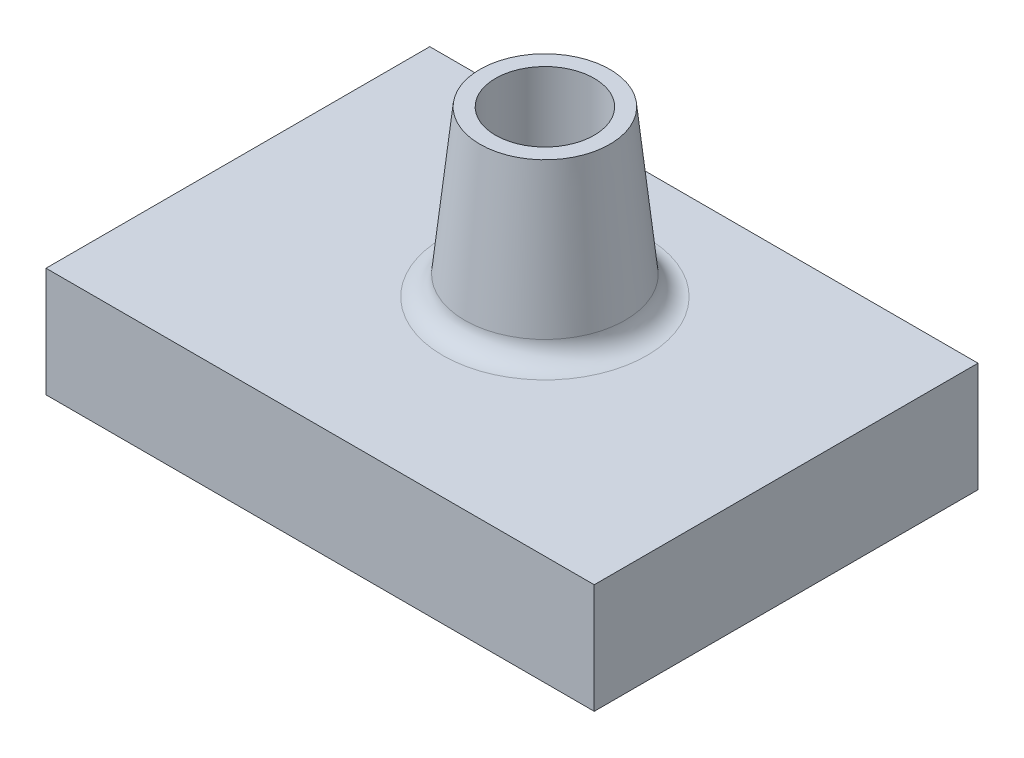
ISO-10303-21;
HEADER;
FILE_DESCRIPTION(('STEP AP214'),'2;1');
FILE_NAME('part.step','',(''),(''),'','','');
FILE_SCHEMA(('AUTOMOTIVE_DESIGN { 1 0 10303 214 1 1 1 1 }'));
ENDSEC;
DATA;
#1=APPLICATION_CONTEXT('core data for automotive mechanical design processes');
#2=APPLICATION_PROTOCOL_DEFINITION('international standard','automotive_design',2000,#1);
#3=PRODUCT_CONTEXT('',#1,'mechanical');
#4=PRODUCT('Part','Part','',(#3));
#5=PRODUCT_RELATED_PRODUCT_CATEGORY('part','',(#4));
#6=PRODUCT_DEFINITION_FORMATION('','',#4);
#7=PRODUCT_DEFINITION_CONTEXT('part definition',#1,'design');
#8=PRODUCT_DEFINITION('design','',#6,#7);
#9=PRODUCT_DEFINITION_SHAPE('','',#8);
#10=(LENGTH_UNIT() NAMED_UNIT(*) SI_UNIT(.MILLI.,.METRE.));
#11=(NAMED_UNIT(*) PLANE_ANGLE_UNIT() SI_UNIT($,.RADIAN.));
#12=(NAMED_UNIT(*) SI_UNIT($,.STERADIAN.) SOLID_ANGLE_UNIT());
#13=UNCERTAINTY_MEASURE_WITH_UNIT(LENGTH_MEASURE(1.E-05),#10,'distance_accuracy_value','');
#14=(GEOMETRIC_REPRESENTATION_CONTEXT(3) GLOBAL_UNCERTAINTY_ASSIGNED_CONTEXT((#13)) GLOBAL_UNIT_ASSIGNED_CONTEXT((#10,
#11,#12)) REPRESENTATION_CONTEXT('',''));
#15=CARTESIAN_POINT('',(0.,0.,0.));
#16=DIRECTION('',(0.,0.,1.));
#17=DIRECTION('',(1.,0.,0.));
#18=AXIS2_PLACEMENT_3D('',#15,#16,#17);
#19=CARTESIAN_POINT('',(25.,10.,-17.5));
#20=DIRECTION('',(-1.,0.,0.));
#21=DIRECTION('',(0.,0.,1.));
#22=AXIS2_PLACEMENT_3D('',#19,#20,#21);
#23=PLANE('',#22);
#24=DIRECTION('',(0.,0.,-1.));
#25=VECTOR('',#24,1.);
#26=CARTESIAN_POINT('',(25.,0.,-17.5));
#27=LINE('',#26,#25);
#28=CARTESIAN_POINT('',(25.,0.,17.5));
#29=VERTEX_POINT('',#28);
#30=CARTESIAN_POINT('',(25.,0.,-17.5));
#31=VERTEX_POINT('',#30);
#32=EDGE_CURVE('E100',#29,#31,#27,.T.);
#33=ORIENTED_EDGE('',*,*,#32,.T.);
#34=DIRECTION('',(0.,-1.,0.));
#35=VECTOR('',#34,1.);
#36=CARTESIAN_POINT('',(25.,10.,-17.5));
#37=LINE('',#36,#35);
#38=CARTESIAN_POINT('',(25.,10.,-17.5));
#39=VERTEX_POINT('',#38);
#40=EDGE_CURVE('E91',#39,#31,#37,.T.);
#41=ORIENTED_EDGE('',*,*,#40,.F.);
#42=DIRECTION('',(0.,0.,-1.));
#43=VECTOR('',#42,1.);
#44=CARTESIAN_POINT('',(25.,10.,-17.5));
#45=LINE('',#44,#43);
#46=CARTESIAN_POINT('',(25.,10.,17.5));
#47=VERTEX_POINT('',#46);
#48=EDGE_CURVE('E85',#47,#39,#45,.T.);
#49=ORIENTED_EDGE('',*,*,#48,.F.);
#50=DIRECTION('',(0.,-1.,0.));
#51=VECTOR('',#50,1.);
#52=CARTESIAN_POINT('',(25.,10.,17.5));
#53=LINE('',#52,#51);
#54=EDGE_CURVE('E96',#47,#29,#53,.T.);
#55=ORIENTED_EDGE('',*,*,#54,.T.);
#56=EDGE_LOOP('',(#33,#41,#49,#55));
#57=FACE_BOUND('',#56,.T.);
#58=ADVANCED_FACE('F32',(#57),#23,.F.);
#59=CARTESIAN_POINT('',(-25.,10.,-17.5));
#60=DIRECTION('',(0.,0.,1.));
#61=DIRECTION('',(1.,0.,0.));
#62=AXIS2_PLACEMENT_3D('',#59,#60,#61);
#63=PLANE('',#62);
#64=DIRECTION('',(-1.,0.,0.));
#65=VECTOR('',#64,1.);
#66=CARTESIAN_POINT('',(-25.,0.,-17.5));
#67=LINE('',#66,#65);
#68=CARTESIAN_POINT('',(-25.,0.,-17.5));
#69=VERTEX_POINT('',#68);
#70=EDGE_CURVE('E90',#31,#69,#67,.T.);
#71=ORIENTED_EDGE('',*,*,#70,.T.);
#72=DIRECTION('',(0.,-1.,0.));
#73=VECTOR('',#72,1.);
#74=CARTESIAN_POINT('',(-25.,10.,-17.5));
#75=LINE('',#74,#73);
#76=CARTESIAN_POINT('',(-25.,10.,-17.5));
#77=VERTEX_POINT('',#76);
#78=EDGE_CURVE('E88',#77,#69,#75,.T.);
#79=ORIENTED_EDGE('',*,*,#78,.F.);
#80=DIRECTION('',(-1.,0.,0.));
#81=VECTOR('',#80,1.);
#82=CARTESIAN_POINT('',(-25.,10.,-17.5));
#83=LINE('',#82,#81);
#84=EDGE_CURVE('E80',#39,#77,#83,.T.);
#85=ORIENTED_EDGE('',*,*,#84,.F.);
#86=ORIENTED_EDGE('',*,*,#40,.T.);
#87=EDGE_LOOP('',(#71,#79,#85,#86));
#88=FACE_BOUND('',#87,.T.);
#89=ADVANCED_FACE('F89',(#88),#63,.F.);
#90=CARTESIAN_POINT('',(-25.,10.,-17.5));
#91=DIRECTION('',(1.,0.,0.));
#92=DIRECTION('',(0.,0.,-1.));
#93=AXIS2_PLACEMENT_3D('',#90,#91,#92);
#94=PLANE('',#93);
#95=DIRECTION('',(0.,0.,1.));
#96=VECTOR('',#95,1.);
#97=CARTESIAN_POINT('',(-25.,0.,-17.5));
#98=LINE('',#97,#96);
#99=CARTESIAN_POINT('',(-25.,0.,17.5));
#100=VERTEX_POINT('',#99);
#101=EDGE_CURVE('E66',#69,#100,#98,.T.);
#102=ORIENTED_EDGE('',*,*,#101,.T.);
#103=DIRECTION('',(0.,-1.,0.));
#104=VECTOR('',#103,1.);
#105=CARTESIAN_POINT('',(-25.,10.,17.5));
#106=LINE('',#105,#104);
#107=CARTESIAN_POINT('',(-25.,10.,17.5));
#108=VERTEX_POINT('',#107);
#109=EDGE_CURVE('E92',#108,#100,#106,.T.);
#110=ORIENTED_EDGE('',*,*,#109,.F.);
#111=DIRECTION('',(0.,0.,1.));
#112=VECTOR('',#111,1.);
#113=CARTESIAN_POINT('',(-25.,10.,-17.5));
#114=LINE('',#113,#112);
#115=EDGE_CURVE('E83',#77,#108,#114,.T.);
#116=ORIENTED_EDGE('',*,*,#115,.F.);
#117=ORIENTED_EDGE('',*,*,#78,.T.);
#118=EDGE_LOOP('',(#102,#110,#116,#117));
#119=FACE_BOUND('',#118,.T.);
#120=ADVANCED_FACE('F94',(#119),#94,.F.);
#121=CARTESIAN_POINT('',(-25.,10.,17.5));
#122=DIRECTION('',(0.,0.,-1.));
#123=DIRECTION('',(-1.,0.,0.));
#124=AXIS2_PLACEMENT_3D('',#121,#122,#123);
#125=PLANE('',#124);
#126=DIRECTION('',(1.,0.,0.));
#127=VECTOR('',#126,1.);
#128=CARTESIAN_POINT('',(-25.,0.,17.5));
#129=LINE('',#128,#127);
#130=EDGE_CURVE('E72',#100,#29,#129,.T.);
#131=ORIENTED_EDGE('',*,*,#130,.T.);
#132=ORIENTED_EDGE('',*,*,#54,.F.);
#133=DIRECTION('',(1.,0.,0.));
#134=VECTOR('',#133,1.);
#135=CARTESIAN_POINT('',(-25.,10.,17.5));
#136=LINE('',#135,#134);
#137=EDGE_CURVE('E49',#108,#47,#136,.T.);
#138=ORIENTED_EDGE('',*,*,#137,.F.);
#139=ORIENTED_EDGE('',*,*,#109,.T.);
#140=EDGE_LOOP('',(#131,#132,#138,#139));
#141=FACE_BOUND('',#140,.T.);
#142=ADVANCED_FACE('F134',(#141),#125,.F.);
#143=CARTESIAN_POINT('',(0.,10.,0.));
#144=DIRECTION('',(0.,1.,0.));
#145=DIRECTION('',(0.,0.,1.));
#146=AXIS2_PLACEMENT_3D('',#143,#144,#145);
#147=PLANE('',#146);
#148=CARTESIAN_POINT('',(0.,10.,-3.00000000000002));
#149=DIRECTION('',(0.,1.,0.));
#150=DIRECTION('',(0.,0.,1.));
#151=AXIS2_PLACEMENT_3D('',#148,#149,#150);
#152=CIRCLE('',#151,9.30080808859568);
#153=CARTESIAN_POINT('',(0.,10.,6.30080808859566));
#154=VERTEX_POINT('',#153);
#155=EDGE_CURVE('E11',#154,#154,#152,.F.);
#156=ORIENTED_EDGE('',*,*,#155,.T.);
#157=EDGE_LOOP('',(#156));
#158=FACE_BOUND('',#157,.T.);
#159=ORIENTED_EDGE('',*,*,#48,.T.);
#160=ORIENTED_EDGE('',*,*,#84,.T.);
#161=ORIENTED_EDGE('',*,*,#115,.T.);
#162=ORIENTED_EDGE('',*,*,#137,.T.);
#163=EDGE_LOOP('',(#159,#160,#161,#162));
#164=FACE_BOUND('',#163,.T.);
#165=ADVANCED_FACE('F81',(#158,#164),#147,.T.);
#166=CARTESIAN_POINT('',(0.,0.,0.));
#167=DIRECTION('',(0.,1.,0.));
#168=DIRECTION('',(0.,0.,1.));
#169=AXIS2_PLACEMENT_3D('',#166,#167,#168);
#170=PLANE('',#169);
#171=ORIENTED_EDGE('',*,*,#32,.F.);
#172=ORIENTED_EDGE('',*,*,#130,.F.);
#173=ORIENTED_EDGE('',*,*,#101,.F.);
#174=ORIENTED_EDGE('',*,*,#70,.F.);
#175=EDGE_LOOP('',(#171,#172,#173,#174));
#176=FACE_BOUND('',#175,.T.);
#177=ADVANCED_FACE('F137',(#176),#170,.F.);
#178=CARTESIAN_POINT('',(0.,10.,-3.00000000000002));
#179=DIRECTION('',(0.,-1.,0.));
#180=DIRECTION('',(0.,0.,1.));
#181=AXIS2_PLACEMENT_3D('',#178,#179,#180);
#182=CONICAL_SURFACE('',#181,7.5,0.10471975511966);
#183=CARTESIAN_POINT('',(0.,11.7909430734647,-3.00000000000002));
#184=DIRECTION('',(0.,1.,0.));
#185=DIRECTION('',(0.,0.,1.));
#186=AXIS2_PLACEMENT_3D('',#183,#184,#185);
#187=CIRCLE('',#186,7.31176429785913);
#188=CARTESIAN_POINT('',(0.,11.7909430734647,4.31176429785912));
#189=VERTEX_POINT('',#188);
#190=EDGE_CURVE('E41',#189,#189,#187,.T.);
#191=ORIENTED_EDGE('',*,*,#190,.T.);
#192=EDGE_LOOP('',(#191));
#193=FACE_BOUND('',#192,.T.);
#194=CARTESIAN_POINT('',(0.,25.,-3.00000000000002));
#195=DIRECTION('',(0.,1.,0.));
#196=DIRECTION('',(0.,0.,1.));
#197=AXIS2_PLACEMENT_3D('',#194,#195,#196);
#198=CIRCLE('',#197,5.92343647101485);
#199=CARTESIAN_POINT('',(0.,25.,2.92343647101483));
#200=VERTEX_POINT('',#199);
#201=EDGE_CURVE('E103',#200,#200,#198,.T.);
#202=ORIENTED_EDGE('',*,*,#201,.F.);
#203=EDGE_LOOP('',(#202));
#204=FACE_BOUND('',#203,.T.);
#205=ADVANCED_FACE('F112',(#193,#204),#182,.T.);
#206=CARTESIAN_POINT('',(0.,25.,-3.00000000000002));
#207=DIRECTION('',(0.,1.,0.));
#208=DIRECTION('',(0.,0.,1.));
#209=AXIS2_PLACEMENT_3D('',#206,#207,#208);
#210=PLANE('',#209);
#211=CARTESIAN_POINT('',(0.,25.,-3.00000000000002));
#212=DIRECTION('',(0.,1.,0.));
#213=DIRECTION('',(0.,0.,1.));
#214=AXIS2_PLACEMENT_3D('',#211,#212,#213);
#215=CIRCLE('',#214,4.5);
#216=CARTESIAN_POINT('',(0.,25.,1.49999999999998));
#217=VERTEX_POINT('',#216);
#218=EDGE_CURVE('E160',#217,#217,#215,.T.);
#219=ORIENTED_EDGE('',*,*,#218,.F.);
#220=EDGE_LOOP('',(#219));
#221=FACE_BOUND('',#220,.T.);
#222=ORIENTED_EDGE('',*,*,#201,.T.);
#223=EDGE_LOOP('',(#222));
#224=FACE_BOUND('',#223,.T.);
#225=ADVANCED_FACE('F146',(#221,#224),#210,.T.);
#226=CARTESIAN_POINT('',(0.,10.,-3.00000000000002));
#227=DIRECTION('',(0.,1.,0.));
#228=DIRECTION('',(0.,0.,1.));
#229=AXIS2_PLACEMENT_3D('',#226,#227,#228);
#230=CYLINDRICAL_SURFACE('',#229,4.5);
#231=CARTESIAN_POINT('',(0.,10.,-3.00000000000002));
#232=DIRECTION('',(0.,1.,0.));
#233=DIRECTION('',(0.,0.,1.));
#234=AXIS2_PLACEMENT_3D('',#231,#232,#233);
#235=CIRCLE('',#234,4.5);
#236=CARTESIAN_POINT('',(0.,10.,1.49999999999998));
#237=VERTEX_POINT('',#236);
#238=EDGE_CURVE('E157',#237,#237,#235,.T.);
#239=ORIENTED_EDGE('',*,*,#238,.F.);
#240=EDGE_LOOP('',(#239));
#241=FACE_BOUND('',#240,.T.);
#242=ORIENTED_EDGE('',*,*,#218,.T.);
#243=EDGE_LOOP('',(#242));
#244=FACE_BOUND('',#243,.T.);
#245=ADVANCED_FACE('F121',(#241,#244),#230,.F.);
#246=CARTESIAN_POINT('',(0.,10.,-3.00000000000002));
#247=DIRECTION('',(0.,1.,0.));
#248=DIRECTION('',(0.,0.,1.));
#249=AXIS2_PLACEMENT_3D('',#246,#247,#248);
#250=PLANE('',#249);
#251=ORIENTED_EDGE('',*,*,#238,.T.);
#252=EDGE_LOOP('',(#251));
#253=FACE_BOUND('',#252,.T.);
#254=ADVANCED_FACE('F116',(#253),#250,.T.);
#255=CARTESIAN_POINT('',(0.,12.,-3.00000000000002));
#256=DIRECTION('',(0.,1.,0.));
#257=DIRECTION('',(0.,0.,1.));
#258=AXIS2_PLACEMENT_3D('',#255,#256,#257);
#259=TOROIDAL_SURFACE('',#258,9.30080808859568,2.);
#260=ORIENTED_EDGE('',*,*,#155,.F.);
#261=EDGE_LOOP('',(#260));
#262=FACE_BOUND('',#261,.T.);
#263=ORIENTED_EDGE('',*,*,#190,.F.);
#264=EDGE_LOOP('',(#263));
#265=FACE_BOUND('',#264,.T.);
#266=ADVANCED_FACE('F34',(#262,#265),#259,.F.);
#267=CLOSED_SHELL('',(#58,#89,#120,#142,#165,#177,#205,#225,#245,#254,#266));
#268=MANIFOLD_SOLID_BREP('B2',#267);
#269=ADVANCED_BREP_SHAPE_REPRESENTATION('',(#18,#268),#14);
#270=SHAPE_DEFINITION_REPRESENTATION(#9,#269);
ENDSEC;
END-ISO-10303-21;
